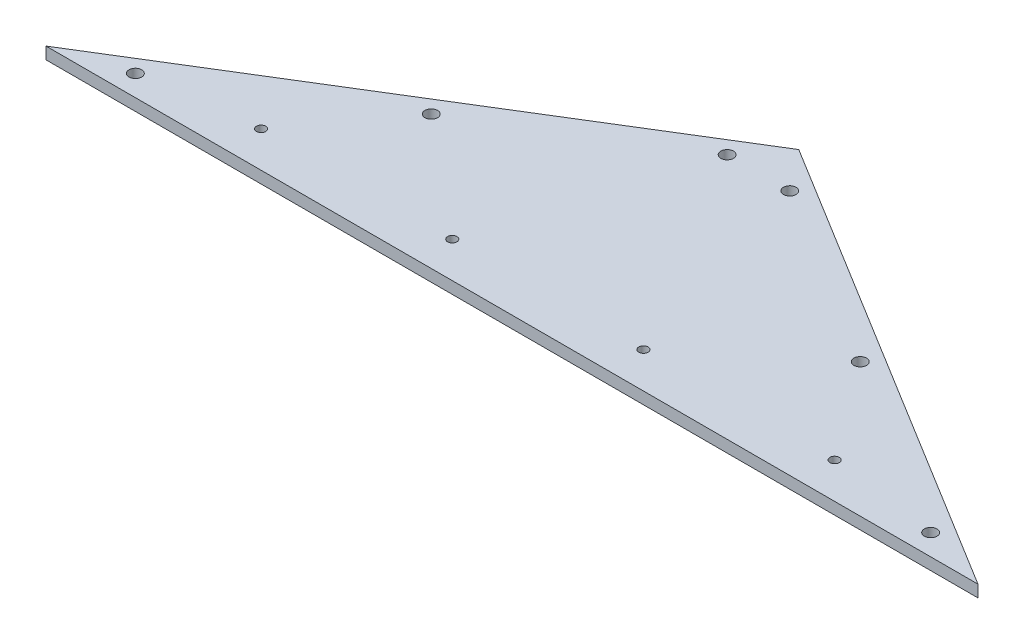
ISO-10303-21;
HEADER;
FILE_DESCRIPTION(('STEP AP214'),'2;1');
FILE_NAME('part.step','',(''),(''),'','','');
FILE_SCHEMA(('AUTOMOTIVE_DESIGN { 1 0 10303 214 1 1 1 1 }'));
ENDSEC;
DATA;
#1=APPLICATION_CONTEXT('core data for automotive mechanical design processes');
#2=APPLICATION_PROTOCOL_DEFINITION('international standard','automotive_design',2000,#1);
#3=PRODUCT_CONTEXT('',#1,'mechanical');
#4=PRODUCT('Part','Part','',(#3));
#5=PRODUCT_RELATED_PRODUCT_CATEGORY('part','',(#4));
#6=PRODUCT_DEFINITION_FORMATION('','',#4);
#7=PRODUCT_DEFINITION_CONTEXT('part definition',#1,'design');
#8=PRODUCT_DEFINITION('design','',#6,#7);
#9=PRODUCT_DEFINITION_SHAPE('','',#8);
#10=(LENGTH_UNIT() NAMED_UNIT(*) SI_UNIT(.MILLI.,.METRE.));
#11=(NAMED_UNIT(*) PLANE_ANGLE_UNIT() SI_UNIT($,.RADIAN.));
#12=(NAMED_UNIT(*) SI_UNIT($,.STERADIAN.) SOLID_ANGLE_UNIT());
#13=UNCERTAINTY_MEASURE_WITH_UNIT(LENGTH_MEASURE(1.E-05),#10,'distance_accuracy_value','');
#14=(GEOMETRIC_REPRESENTATION_CONTEXT(3) GLOBAL_UNCERTAINTY_ASSIGNED_CONTEXT((#13)) GLOBAL_UNIT_ASSIGNED_CONTEXT((#10,
#11,#12)) REPRESENTATION_CONTEXT('',''));
#15=CARTESIAN_POINT('',(0.,0.,0.));
#16=DIRECTION('',(0.,0.,1.));
#17=DIRECTION('',(1.,0.,0.));
#18=AXIS2_PLACEMENT_3D('',#15,#16,#17);
#19=CARTESIAN_POINT('',(495.3,6.35,0.));
#20=DIRECTION('',(0.,0.,-1.));
#21=DIRECTION('',(-1.,0.,0.));
#22=AXIS2_PLACEMENT_3D('',#19,#20,#21);
#23=PLANE('',#22);
#24=DIRECTION('',(1.,0.,0.));
#25=VECTOR('',#24,1.);
#26=CARTESIAN_POINT('',(495.3,0.,0.));
#27=LINE('',#26,#25);
#28=CARTESIAN_POINT('',(0.,0.,0.));
#29=VERTEX_POINT('',#28);
#30=CARTESIAN_POINT('',(495.3,0.,0.));
#31=VERTEX_POINT('',#30);
#32=EDGE_CURVE('E83',#29,#31,#27,.T.);
#33=ORIENTED_EDGE('',*,*,#32,.T.);
#34=DIRECTION('',(0.,-1.,0.));
#35=VECTOR('',#34,1.);
#36=CARTESIAN_POINT('',(495.3,6.35,0.));
#37=LINE('',#36,#35);
#38=CARTESIAN_POINT('',(495.3,6.35,0.));
#39=VERTEX_POINT('',#38);
#40=EDGE_CURVE('E11',#39,#31,#37,.T.);
#41=ORIENTED_EDGE('',*,*,#40,.F.);
#42=DIRECTION('',(1.,0.,0.));
#43=VECTOR('',#42,1.);
#44=CARTESIAN_POINT('',(495.3,6.35,0.));
#45=LINE('',#44,#43);
#46=CARTESIAN_POINT('',(0.,6.35,0.));
#47=VERTEX_POINT('',#46);
#48=EDGE_CURVE('E76',#47,#39,#45,.T.);
#49=ORIENTED_EDGE('',*,*,#48,.F.);
#50=DIRECTION('',(0.,-1.,0.));
#51=VECTOR('',#50,1.);
#52=CARTESIAN_POINT('',(0.,6.35,0.));
#53=LINE('',#52,#51);
#54=EDGE_CURVE('E84',#47,#29,#53,.T.);
#55=ORIENTED_EDGE('',*,*,#54,.T.);
#56=EDGE_LOOP('',(#33,#41,#49,#55));
#57=FACE_BOUND('',#56,.T.);
#58=ADVANCED_FACE('F36',(#57),#23,.F.);
#59=CARTESIAN_POINT('',(247.65,6.35,-152.4));
#60=DIRECTION('',(-0.524097425664335,0.,0.851658316704544));
#61=DIRECTION('',(0.851658316704544,0.,0.524097425664335));
#62=AXIS2_PLACEMENT_3D('',#59,#60,#61);
#63=PLANE('',#62);
#64=DIRECTION('',(-0.851658316704544,0.,-0.524097425664335));
#65=VECTOR('',#64,1.);
#66=CARTESIAN_POINT('',(247.65,0.,-152.4));
#67=LINE('',#66,#65);
#68=CARTESIAN_POINT('',(247.65,0.,-152.4));
#69=VERTEX_POINT('',#68);
#70=EDGE_CURVE('E64',#31,#69,#67,.T.);
#71=ORIENTED_EDGE('',*,*,#70,.T.);
#72=DIRECTION('',(0.,-1.,0.));
#73=VECTOR('',#72,1.);
#74=CARTESIAN_POINT('',(247.65,6.35,-152.4));
#75=LINE('',#74,#73);
#76=CARTESIAN_POINT('',(247.65,6.35,-152.4));
#77=VERTEX_POINT('',#76);
#78=EDGE_CURVE('E44',#77,#69,#75,.T.);
#79=ORIENTED_EDGE('',*,*,#78,.F.);
#80=DIRECTION('',(-0.851658316704544,0.,-0.524097425664335));
#81=VECTOR('',#80,1.);
#82=CARTESIAN_POINT('',(247.65,6.35,-152.4));
#83=LINE('',#82,#81);
#84=EDGE_CURVE('E72',#39,#77,#83,.T.);
#85=ORIENTED_EDGE('',*,*,#84,.F.);
#86=ORIENTED_EDGE('',*,*,#40,.T.);
#87=EDGE_LOOP('',(#71,#79,#85,#86));
#88=FACE_BOUND('',#87,.T.);
#89=ADVANCED_FACE('F73',(#88),#63,.F.);
#90=CARTESIAN_POINT('',(0.,6.35,0.));
#91=DIRECTION('',(0.524097425664334,0.,0.851658316704544));
#92=DIRECTION('',(0.851658316704544,0.,-0.524097425664335));
#93=AXIS2_PLACEMENT_3D('',#90,#91,#92);
#94=PLANE('',#93);
#95=DIRECTION('',(-0.851658316704544,0.,0.524097425664334));
#96=VECTOR('',#95,1.);
#97=CARTESIAN_POINT('',(0.,0.,0.));
#98=LINE('',#97,#96);
#99=EDGE_CURVE('E69',#69,#29,#98,.T.);
#100=ORIENTED_EDGE('',*,*,#99,.T.);
#101=ORIENTED_EDGE('',*,*,#54,.F.);
#102=DIRECTION('',(-0.851658316704544,0.,0.524097425664334));
#103=VECTOR('',#102,1.);
#104=CARTESIAN_POINT('',(0.,6.35,0.));
#105=LINE('',#104,#103);
#106=EDGE_CURVE('E52',#77,#47,#105,.T.);
#107=ORIENTED_EDGE('',*,*,#106,.F.);
#108=ORIENTED_EDGE('',*,*,#78,.T.);
#109=EDGE_LOOP('',(#100,#101,#107,#108));
#110=FACE_BOUND('',#109,.T.);
#111=ADVANCED_FACE('F95',(#110),#94,.F.);
#112=CARTESIAN_POINT('',(0.,6.35,0.));
#113=DIRECTION('',(0.,-1.,0.));
#114=DIRECTION('',(0.,0.,-1.));
#115=AXIS2_PLACEMENT_3D('',#112,#113,#114);
#116=PLANE('',#115);
#117=CARTESIAN_POINT('',(458.979184463501,6.35,-11.1672084146482));
#118=DIRECTION('',(0.,1.,0.));
#119=DIRECTION('',(0.,0.,1.));
#120=AXIS2_PLACEMENT_3D('',#117,#118,#119);
#121=CIRCLE('',#120,3.36550000000002);
#122=CARTESIAN_POINT('',(458.979184463501,6.35,-7.80170841464816));
#123=VERTEX_POINT('',#122);
#124=EDGE_CURVE('E260',#123,#123,#121,.T.);
#125=ORIENTED_EDGE('',*,*,#124,.F.);
#126=EDGE_LOOP('',(#125));
#127=FACE_BOUND('',#126,.T.);
#128=CARTESIAN_POINT('',(361.634638864172,6.35,-71.0715441680816));
#129=DIRECTION('',(0.,1.,0.));
#130=DIRECTION('',(0.,0.,1.));
#131=AXIS2_PLACEMENT_3D('',#128,#129,#130);
#132=CIRCLE('',#131,3.36550000000002);
#133=CARTESIAN_POINT('',(361.634638864172,6.35,-67.7060441680816));
#134=VERTEX_POINT('',#133);
#135=EDGE_CURVE('E265',#134,#134,#132,.T.);
#136=ORIENTED_EDGE('',*,*,#135,.F.);
#137=EDGE_LOOP('',(#136));
#138=FACE_BOUND('',#137,.T.);
#139=CARTESIAN_POINT('',(264.290093264843,6.35,-130.975879921515));
#140=DIRECTION('',(0.,1.,0.));
#141=DIRECTION('',(0.,0.,1.));
#142=AXIS2_PLACEMENT_3D('',#139,#140,#141);
#143=CIRCLE('',#142,3.36550000000002);
#144=CARTESIAN_POINT('',(264.290093264843,6.35,-127.610379921515));
#145=VERTEX_POINT('',#144);
#146=EDGE_CURVE('E271',#145,#145,#143,.T.);
#147=ORIENTED_EDGE('',*,*,#146,.F.);
#148=EDGE_LOOP('',(#147));
#149=FACE_BOUND('',#148,.T.);
#150=CARTESIAN_POINT('',(36.3208155364986,6.35,-11.1672084146482));
#151=DIRECTION('',(0.,1.,0.));
#152=DIRECTION('',(0.,0.,1.));
#153=AXIS2_PLACEMENT_3D('',#150,#151,#152);
#154=CIRCLE('',#153,3.3655);
#155=CARTESIAN_POINT('',(36.3208155364986,6.35,-7.80170841464818));
#156=VERTEX_POINT('',#155);
#157=EDGE_CURVE('E277',#156,#156,#154,.T.);
#158=ORIENTED_EDGE('',*,*,#157,.F.);
#159=EDGE_LOOP('',(#158));
#160=FACE_BOUND('',#159,.T.);
#161=CARTESIAN_POINT('',(231.009906735157,6.35,-130.975879921515));
#162=DIRECTION('',(0.,1.,0.));
#163=DIRECTION('',(0.,0.,1.));
#164=AXIS2_PLACEMENT_3D('',#161,#162,#163);
#165=CIRCLE('',#164,3.36549999999999);
#166=CARTESIAN_POINT('',(231.009906735157,6.35,-127.610379921515));
#167=VERTEX_POINT('',#166);
#168=EDGE_CURVE('E283',#167,#167,#165,.T.);
#169=ORIENTED_EDGE('',*,*,#168,.F.);
#170=EDGE_LOOP('',(#169));
#171=FACE_BOUND('',#170,.T.);
#172=CARTESIAN_POINT('',(133.665361135828,6.35,-71.0715441680816));
#173=DIRECTION('',(0.,1.,0.));
#174=DIRECTION('',(0.,0.,1.));
#175=AXIS2_PLACEMENT_3D('',#172,#173,#174);
#176=CIRCLE('',#175,3.36549999999999);
#177=CARTESIAN_POINT('',(133.665361135828,6.35,-67.7060441680816));
#178=VERTEX_POINT('',#177);
#179=EDGE_CURVE('E228',#178,#178,#176,.T.);
#180=ORIENTED_EDGE('',*,*,#179,.F.);
#181=EDGE_LOOP('',(#180));
#182=FACE_BOUND('',#181,.T.);
#183=CARTESIAN_POINT('',(196.85,6.35,-19.05));
#184=DIRECTION('',(0.,1.,0.));
#185=DIRECTION('',(0.,0.,1.));
#186=AXIS2_PLACEMENT_3D('',#183,#184,#185);
#187=CIRCLE('',#186,2.4638);
#188=CARTESIAN_POINT('',(196.85,6.35,-16.5862));
#189=VERTEX_POINT('',#188);
#190=EDGE_CURVE('E237',#189,#189,#187,.T.);
#191=ORIENTED_EDGE('',*,*,#190,.F.);
#192=EDGE_LOOP('',(#191));
#193=FACE_BOUND('',#192,.T.);
#194=CARTESIAN_POINT('',(298.45,6.35,-19.05));
#195=DIRECTION('',(0.,1.,0.));
#196=DIRECTION('',(0.,0.,1.));
#197=AXIS2_PLACEMENT_3D('',#194,#195,#196);
#198=CIRCLE('',#197,2.4638);
#199=CARTESIAN_POINT('',(298.45,6.35,-16.5862));
#200=VERTEX_POINT('',#199);
#201=EDGE_CURVE('E225',#200,#200,#198,.T.);
#202=ORIENTED_EDGE('',*,*,#201,.F.);
#203=EDGE_LOOP('',(#202));
#204=FACE_BOUND('',#203,.T.);
#205=CARTESIAN_POINT('',(400.05,6.35,-19.05));
#206=DIRECTION('',(0.,1.,0.));
#207=DIRECTION('',(0.,0.,1.));
#208=AXIS2_PLACEMENT_3D('',#205,#206,#207);
#209=CIRCLE('',#208,2.4638);
#210=CARTESIAN_POINT('',(400.05,6.35,-16.5862));
#211=VERTEX_POINT('',#210);
#212=EDGE_CURVE('E221',#211,#211,#209,.T.);
#213=ORIENTED_EDGE('',*,*,#212,.F.);
#214=EDGE_LOOP('',(#213));
#215=FACE_BOUND('',#214,.T.);
#216=CARTESIAN_POINT('',(95.25,6.35,-19.05));
#217=DIRECTION('',(0.,1.,0.));
#218=DIRECTION('',(0.,0.,1.));
#219=AXIS2_PLACEMENT_3D('',#216,#217,#218);
#220=CIRCLE('',#219,2.4638);
#221=CARTESIAN_POINT('',(95.25,6.35,-16.5862));
#222=VERTEX_POINT('',#221);
#223=EDGE_CURVE('E90',#222,#222,#220,.T.);
#224=ORIENTED_EDGE('',*,*,#223,.F.);
#225=EDGE_LOOP('',(#224));
#226=FACE_BOUND('',#225,.T.);
#227=ORIENTED_EDGE('',*,*,#48,.T.);
#228=ORIENTED_EDGE('',*,*,#84,.T.);
#229=ORIENTED_EDGE('',*,*,#106,.T.);
#230=EDGE_LOOP('',(#227,#228,#229));
#231=FACE_BOUND('',#230,.T.);
#232=ADVANCED_FACE('F79',(#127,#138,#149,#160,#171,#182,#193,#204,#215,#226,#231),#116,.F.);
#233=CARTESIAN_POINT('',(0.,0.,0.));
#234=DIRECTION('',(0.,-1.,0.));
#235=DIRECTION('',(0.,0.,-1.));
#236=AXIS2_PLACEMENT_3D('',#233,#234,#235);
#237=PLANE('',#236);
#238=CARTESIAN_POINT('',(458.979184463501,0.,-11.1672084146482));
#239=DIRECTION('',(0.,1.,0.));
#240=DIRECTION('',(0.,0.,1.));
#241=AXIS2_PLACEMENT_3D('',#238,#239,#240);
#242=CIRCLE('',#241,3.36550000000002);
#243=CARTESIAN_POINT('',(458.979184463501,0.,-7.80170841464816));
#244=VERTEX_POINT('',#243);
#245=EDGE_CURVE('E263',#244,#244,#242,.T.);
#246=ORIENTED_EDGE('',*,*,#245,.T.);
#247=EDGE_LOOP('',(#246));
#248=FACE_BOUND('',#247,.T.);
#249=CARTESIAN_POINT('',(361.634638864172,0.,-71.0715441680816));
#250=DIRECTION('',(0.,1.,0.));
#251=DIRECTION('',(0.,0.,1.));
#252=AXIS2_PLACEMENT_3D('',#249,#250,#251);
#253=CIRCLE('',#252,3.36550000000002);
#254=CARTESIAN_POINT('',(361.634638864172,0.,-67.7060441680816));
#255=VERTEX_POINT('',#254);
#256=EDGE_CURVE('E268',#255,#255,#253,.T.);
#257=ORIENTED_EDGE('',*,*,#256,.T.);
#258=EDGE_LOOP('',(#257));
#259=FACE_BOUND('',#258,.T.);
#260=CARTESIAN_POINT('',(264.290093264843,0.,-130.975879921515));
#261=DIRECTION('',(0.,1.,0.));
#262=DIRECTION('',(0.,0.,1.));
#263=AXIS2_PLACEMENT_3D('',#260,#261,#262);
#264=CIRCLE('',#263,3.36550000000002);
#265=CARTESIAN_POINT('',(264.290093264843,0.,-127.610379921515));
#266=VERTEX_POINT('',#265);
#267=EDGE_CURVE('E274',#266,#266,#264,.T.);
#268=ORIENTED_EDGE('',*,*,#267,.T.);
#269=EDGE_LOOP('',(#268));
#270=FACE_BOUND('',#269,.T.);
#271=CARTESIAN_POINT('',(36.3208155364986,0.,-11.1672084146482));
#272=DIRECTION('',(0.,1.,0.));
#273=DIRECTION('',(0.,0.,1.));
#274=AXIS2_PLACEMENT_3D('',#271,#272,#273);
#275=CIRCLE('',#274,3.3655);
#276=CARTESIAN_POINT('',(36.3208155364986,0.,-7.80170841464818));
#277=VERTEX_POINT('',#276);
#278=EDGE_CURVE('E280',#277,#277,#275,.T.);
#279=ORIENTED_EDGE('',*,*,#278,.T.);
#280=EDGE_LOOP('',(#279));
#281=FACE_BOUND('',#280,.T.);
#282=CARTESIAN_POINT('',(231.009906735157,0.,-130.975879921515));
#283=DIRECTION('',(0.,1.,0.));
#284=DIRECTION('',(0.,0.,1.));
#285=AXIS2_PLACEMENT_3D('',#282,#283,#284);
#286=CIRCLE('',#285,3.36549999999999);
#287=CARTESIAN_POINT('',(231.009906735157,0.,-127.610379921515));
#288=VERTEX_POINT('',#287);
#289=EDGE_CURVE('E258',#288,#288,#286,.T.);
#290=ORIENTED_EDGE('',*,*,#289,.T.);
#291=EDGE_LOOP('',(#290));
#292=FACE_BOUND('',#291,.T.);
#293=CARTESIAN_POINT('',(133.665361135828,0.,-71.0715441680816));
#294=DIRECTION('',(0.,1.,0.));
#295=DIRECTION('',(0.,0.,1.));
#296=AXIS2_PLACEMENT_3D('',#293,#294,#295);
#297=CIRCLE('',#296,3.36549999999999);
#298=CARTESIAN_POINT('',(133.665361135828,0.,-67.7060441680816));
#299=VERTEX_POINT('',#298);
#300=EDGE_CURVE('E223',#299,#299,#297,.T.);
#301=ORIENTED_EDGE('',*,*,#300,.T.);
#302=EDGE_LOOP('',(#301));
#303=FACE_BOUND('',#302,.T.);
#304=CARTESIAN_POINT('',(196.85,0.,-19.05));
#305=DIRECTION('',(0.,1.,0.));
#306=DIRECTION('',(0.,0.,1.));
#307=AXIS2_PLACEMENT_3D('',#304,#305,#306);
#308=CIRCLE('',#307,2.4638);
#309=CARTESIAN_POINT('',(196.85,0.,-16.5862));
#310=VERTEX_POINT('',#309);
#311=EDGE_CURVE('E233',#310,#310,#308,.T.);
#312=ORIENTED_EDGE('',*,*,#311,.T.);
#313=EDGE_LOOP('',(#312));
#314=FACE_BOUND('',#313,.T.);
#315=CARTESIAN_POINT('',(298.45,0.,-19.05));
#316=DIRECTION('',(0.,1.,0.));
#317=DIRECTION('',(0.,0.,1.));
#318=AXIS2_PLACEMENT_3D('',#315,#316,#317);
#319=CIRCLE('',#318,2.4638);
#320=CARTESIAN_POINT('',(298.45,0.,-16.5862));
#321=VERTEX_POINT('',#320);
#322=EDGE_CURVE('E242',#321,#321,#319,.T.);
#323=ORIENTED_EDGE('',*,*,#322,.T.);
#324=EDGE_LOOP('',(#323));
#325=FACE_BOUND('',#324,.T.);
#326=CARTESIAN_POINT('',(400.05,0.,-19.05));
#327=DIRECTION('',(0.,1.,0.));
#328=DIRECTION('',(0.,0.,1.));
#329=AXIS2_PLACEMENT_3D('',#326,#327,#328);
#330=CIRCLE('',#329,2.4638);
#331=CARTESIAN_POINT('',(400.05,0.,-16.5862));
#332=VERTEX_POINT('',#331);
#333=EDGE_CURVE('E218',#332,#332,#330,.T.);
#334=ORIENTED_EDGE('',*,*,#333,.T.);
#335=EDGE_LOOP('',(#334));
#336=FACE_BOUND('',#335,.T.);
#337=CARTESIAN_POINT('',(95.25,0.,-19.05));
#338=DIRECTION('',(0.,1.,0.));
#339=DIRECTION('',(0.,0.,1.));
#340=AXIS2_PLACEMENT_3D('',#337,#338,#339);
#341=CIRCLE('',#340,2.4638);
#342=CARTESIAN_POINT('',(95.25,0.,-16.5862));
#343=VERTEX_POINT('',#342);
#344=EDGE_CURVE('E86',#343,#343,#341,.T.);
#345=ORIENTED_EDGE('',*,*,#344,.T.);
#346=EDGE_LOOP('',(#345));
#347=FACE_BOUND('',#346,.T.);
#348=ORIENTED_EDGE('',*,*,#32,.F.);
#349=ORIENTED_EDGE('',*,*,#99,.F.);
#350=ORIENTED_EDGE('',*,*,#70,.F.);
#351=EDGE_LOOP('',(#348,#349,#350));
#352=FACE_BOUND('',#351,.T.);
#353=ADVANCED_FACE('F96',(#248,#259,#270,#281,#292,#303,#314,#325,#336,#347,#352),#237,.T.);
#354=CARTESIAN_POINT('',(95.25,0.,-19.05));
#355=DIRECTION('',(0.,1.,0.));
#356=DIRECTION('',(0.,0.,1.));
#357=AXIS2_PLACEMENT_3D('',#354,#355,#356);
#358=CYLINDRICAL_SURFACE('',#357,2.4638);
#359=ORIENTED_EDGE('',*,*,#344,.F.);
#360=EDGE_LOOP('',(#359));
#361=FACE_BOUND('',#360,.T.);
#362=ORIENTED_EDGE('',*,*,#223,.T.);
#363=EDGE_LOOP('',(#362));
#364=FACE_BOUND('',#363,.T.);
#365=ADVANCED_FACE('F98',(#361,#364),#358,.F.);
#366=CARTESIAN_POINT('',(400.05,0.,-19.05));
#367=DIRECTION('',(0.,1.,0.));
#368=DIRECTION('',(0.,0.,1.));
#369=AXIS2_PLACEMENT_3D('',#366,#367,#368);
#370=CYLINDRICAL_SURFACE('',#369,2.4638);
#371=ORIENTED_EDGE('',*,*,#333,.F.);
#372=EDGE_LOOP('',(#371));
#373=FACE_BOUND('',#372,.T.);
#374=ORIENTED_EDGE('',*,*,#212,.T.);
#375=EDGE_LOOP('',(#374));
#376=FACE_BOUND('',#375,.T.);
#377=ADVANCED_FACE('F105',(#373,#376),#370,.F.);
#378=CARTESIAN_POINT('',(298.45,0.,-19.05));
#379=DIRECTION('',(0.,1.,0.));
#380=DIRECTION('',(0.,0.,1.));
#381=AXIS2_PLACEMENT_3D('',#378,#379,#380);
#382=CYLINDRICAL_SURFACE('',#381,2.4638);
#383=ORIENTED_EDGE('',*,*,#322,.F.);
#384=EDGE_LOOP('',(#383));
#385=FACE_BOUND('',#384,.T.);
#386=ORIENTED_EDGE('',*,*,#201,.T.);
#387=EDGE_LOOP('',(#386));
#388=FACE_BOUND('',#387,.T.);
#389=ADVANCED_FACE('F206',(#385,#388),#382,.F.);
#390=CARTESIAN_POINT('',(196.85,0.,-19.05));
#391=DIRECTION('',(0.,1.,0.));
#392=DIRECTION('',(0.,0.,1.));
#393=AXIS2_PLACEMENT_3D('',#390,#391,#392);
#394=CYLINDRICAL_SURFACE('',#393,2.4638);
#395=ORIENTED_EDGE('',*,*,#311,.F.);
#396=EDGE_LOOP('',(#395));
#397=FACE_BOUND('',#396,.T.);
#398=ORIENTED_EDGE('',*,*,#190,.T.);
#399=EDGE_LOOP('',(#398));
#400=FACE_BOUND('',#399,.T.);
#401=ADVANCED_FACE('F133',(#397,#400),#394,.F.);
#402=CARTESIAN_POINT('',(133.665361135828,0.,-71.0715441680816));
#403=DIRECTION('',(0.,1.,0.));
#404=DIRECTION('',(0.,0.,1.));
#405=AXIS2_PLACEMENT_3D('',#402,#403,#404);
#406=CYLINDRICAL_SURFACE('',#405,3.36549999999999);
#407=ORIENTED_EDGE('',*,*,#300,.F.);
#408=EDGE_LOOP('',(#407));
#409=FACE_BOUND('',#408,.T.);
#410=ORIENTED_EDGE('',*,*,#179,.T.);
#411=EDGE_LOOP('',(#410));
#412=FACE_BOUND('',#411,.T.);
#413=ADVANCED_FACE('F143',(#409,#412),#406,.F.);
#414=CARTESIAN_POINT('',(231.009906735157,0.,-130.975879921515));
#415=DIRECTION('',(0.,1.,0.));
#416=DIRECTION('',(0.,0.,1.));
#417=AXIS2_PLACEMENT_3D('',#414,#415,#416);
#418=CYLINDRICAL_SURFACE('',#417,3.36549999999999);
#419=ORIENTED_EDGE('',*,*,#289,.F.);
#420=EDGE_LOOP('',(#419));
#421=FACE_BOUND('',#420,.T.);
#422=ORIENTED_EDGE('',*,*,#168,.T.);
#423=EDGE_LOOP('',(#422));
#424=FACE_BOUND('',#423,.T.);
#425=ADVANCED_FACE('F148',(#421,#424),#418,.F.);
#426=CARTESIAN_POINT('',(36.3208155364986,0.,-11.1672084146482));
#427=DIRECTION('',(0.,1.,0.));
#428=DIRECTION('',(0.,0.,1.));
#429=AXIS2_PLACEMENT_3D('',#426,#427,#428);
#430=CYLINDRICAL_SURFACE('',#429,3.3655);
#431=ORIENTED_EDGE('',*,*,#278,.F.);
#432=EDGE_LOOP('',(#431));
#433=FACE_BOUND('',#432,.T.);
#434=ORIENTED_EDGE('',*,*,#157,.T.);
#435=EDGE_LOOP('',(#434));
#436=FACE_BOUND('',#435,.T.);
#437=ADVANCED_FACE('F158',(#433,#436),#430,.F.);
#438=CARTESIAN_POINT('',(264.290093264843,0.,-130.975879921515));
#439=DIRECTION('',(0.,1.,0.));
#440=DIRECTION('',(0.,0.,1.));
#441=AXIS2_PLACEMENT_3D('',#438,#439,#440);
#442=CYLINDRICAL_SURFACE('',#441,3.36550000000002);
#443=ORIENTED_EDGE('',*,*,#267,.F.);
#444=EDGE_LOOP('',(#443));
#445=FACE_BOUND('',#444,.T.);
#446=ORIENTED_EDGE('',*,*,#146,.T.);
#447=EDGE_LOOP('',(#446));
#448=FACE_BOUND('',#447,.T.);
#449=ADVANCED_FACE('F168',(#445,#448),#442,.F.);
#450=CARTESIAN_POINT('',(361.634638864172,0.,-71.0715441680816));
#451=DIRECTION('',(0.,1.,0.));
#452=DIRECTION('',(0.,0.,1.));
#453=AXIS2_PLACEMENT_3D('',#450,#451,#452);
#454=CYLINDRICAL_SURFACE('',#453,3.36550000000002);
#455=ORIENTED_EDGE('',*,*,#256,.F.);
#456=EDGE_LOOP('',(#455));
#457=FACE_BOUND('',#456,.T.);
#458=ORIENTED_EDGE('',*,*,#135,.T.);
#459=EDGE_LOOP('',(#458));
#460=FACE_BOUND('',#459,.T.);
#461=ADVANCED_FACE('F178',(#457,#460),#454,.F.);
#462=CARTESIAN_POINT('',(458.979184463501,0.,-11.1672084146482));
#463=DIRECTION('',(0.,1.,0.));
#464=DIRECTION('',(0.,0.,1.));
#465=AXIS2_PLACEMENT_3D('',#462,#463,#464);
#466=CYLINDRICAL_SURFACE('',#465,3.36550000000002);
#467=ORIENTED_EDGE('',*,*,#245,.F.);
#468=EDGE_LOOP('',(#467));
#469=FACE_BOUND('',#468,.T.);
#470=ORIENTED_EDGE('',*,*,#124,.T.);
#471=EDGE_LOOP('',(#470));
#472=FACE_BOUND('',#471,.T.);
#473=ADVANCED_FACE('F188',(#469,#472),#466,.F.);
#474=CLOSED_SHELL('',(#58,#89,#111,#232,#353,#365,#377,#389,#401,#413,#425,#437,#449,#461,#473));
#475=MANIFOLD_SOLID_BREP('B2',#474);
#476=ADVANCED_BREP_SHAPE_REPRESENTATION('',(#18,#475),#14);
#477=SHAPE_DEFINITION_REPRESENTATION(#9,#476);
ENDSEC;
END-ISO-10303-21;
